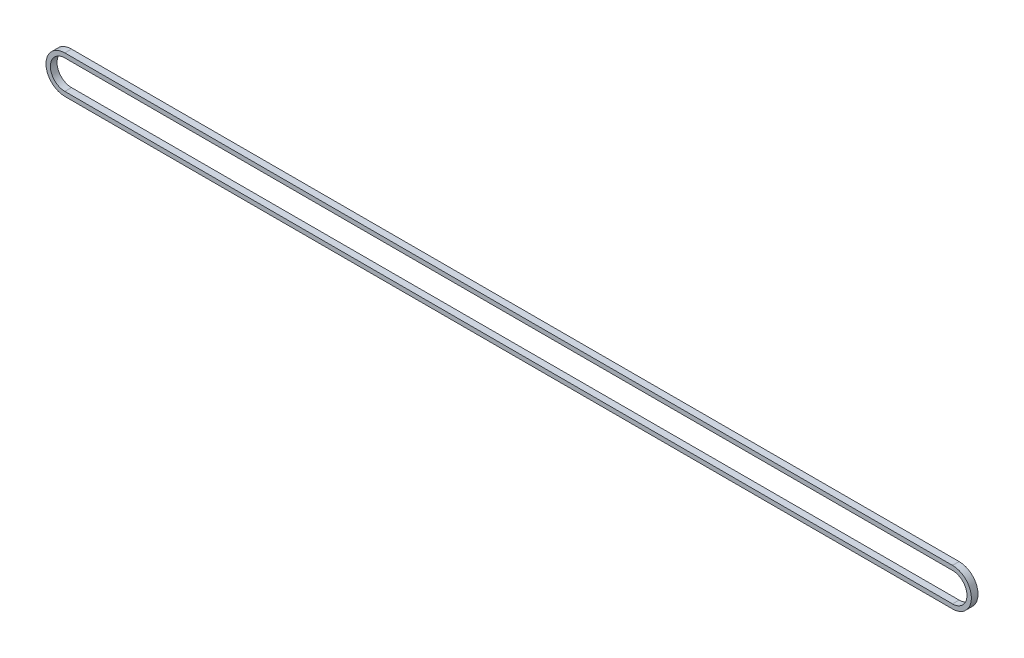
ISO-10303-21;
HEADER;
FILE_DESCRIPTION(('STEP AP214'),'2;1');
FILE_NAME('part.step','',(''),(''),'','','');
FILE_SCHEMA(('AUTOMOTIVE_DESIGN { 1 0 10303 214 1 1 1 1 }'));
ENDSEC;
DATA;
#1=APPLICATION_CONTEXT('core data for automotive mechanical design processes');
#2=APPLICATION_PROTOCOL_DEFINITION('international standard','automotive_design',2000,#1);
#3=PRODUCT_CONTEXT('',#1,'mechanical');
#4=PRODUCT('Part','Part','',(#3));
#5=PRODUCT_RELATED_PRODUCT_CATEGORY('part','',(#4));
#6=PRODUCT_DEFINITION_FORMATION('','',#4);
#7=PRODUCT_DEFINITION_CONTEXT('part definition',#1,'design');
#8=PRODUCT_DEFINITION('design','',#6,#7);
#9=PRODUCT_DEFINITION_SHAPE('','',#8);
#10=(LENGTH_UNIT() NAMED_UNIT(*) SI_UNIT(.MILLI.,.METRE.));
#11=(NAMED_UNIT(*) PLANE_ANGLE_UNIT() SI_UNIT($,.RADIAN.));
#12=(NAMED_UNIT(*) SI_UNIT($,.STERADIAN.) SOLID_ANGLE_UNIT());
#13=UNCERTAINTY_MEASURE_WITH_UNIT(LENGTH_MEASURE(1.E-05),#10,'distance_accuracy_value','');
#14=(GEOMETRIC_REPRESENTATION_CONTEXT(3) GLOBAL_UNCERTAINTY_ASSIGNED_CONTEXT((#13)) GLOBAL_UNIT_ASSIGNED_CONTEXT((#10,
#11,#12)) REPRESENTATION_CONTEXT('',''));
#15=CARTESIAN_POINT('',(0.,0.,0.));
#16=DIRECTION('',(0.,0.,1.));
#17=DIRECTION('',(1.,0.,0.));
#18=AXIS2_PLACEMENT_3D('',#15,#16,#17);
#19=CARTESIAN_POINT('',(0.,0.,4.445));
#20=DIRECTION('',(0.,0.,1.));
#21=DIRECTION('',(1.,0.,0.));
#22=AXIS2_PLACEMENT_3D('',#19,#20,#21);
#23=PLANE('',#22);
#24=CARTESIAN_POINT('',(0.,0.,4.445));
#25=DIRECTION('',(0.,0.,1.));
#26=DIRECTION('',(1.,0.,0.));
#27=AXIS2_PLACEMENT_3D('',#24,#25,#26);
#28=CIRCLE('',#27,25.23069053208);
#29=CARTESIAN_POINT('',(0.,25.23069053208,4.445));
#30=VERTEX_POINT('',#29);
#31=CARTESIAN_POINT('',(0.,-25.23069053208,4.445));
#32=VERTEX_POINT('',#31);
#33=EDGE_CURVE('E157',#30,#32,#28,.T.);
#34=ORIENTED_EDGE('',*,*,#33,.T.);
#35=DIRECTION('',(1.,0.,0.));
#36=VECTOR('',#35,1.);
#37=CARTESIAN_POINT('',(0.,-25.23069053208,4.445));
#38=LINE('',#37,#36);
#39=CARTESIAN_POINT('',(1187.45,-25.23069053208,4.445));
#40=VERTEX_POINT('',#39);
#41=EDGE_CURVE('E160',#32,#40,#38,.T.);
#42=ORIENTED_EDGE('',*,*,#41,.T.);
#43=CARTESIAN_POINT('',(1187.45,0.,4.445));
#44=DIRECTION('',(0.,0.,1.));
#45=DIRECTION('',(1.,0.,0.));
#46=AXIS2_PLACEMENT_3D('',#43,#44,#45);
#47=CIRCLE('',#46,25.23069053208);
#48=CARTESIAN_POINT('',(1187.45,25.23069053208,4.445));
#49=VERTEX_POINT('',#48);
#50=EDGE_CURVE('E163',#40,#49,#47,.T.);
#51=ORIENTED_EDGE('',*,*,#50,.T.);
#52=DIRECTION('',(-1.,0.,0.));
#53=VECTOR('',#52,1.);
#54=CARTESIAN_POINT('',(0.,25.23069053208,4.445));
#55=LINE('',#54,#53);
#56=EDGE_CURVE('E165',#49,#30,#55,.T.);
#57=ORIENTED_EDGE('',*,*,#56,.T.);
#58=EDGE_LOOP('',(#34,#42,#51,#57));
#59=FACE_BOUND('',#58,.T.);
#60=DIRECTION('',(1.,0.,0.));
#61=VECTOR('',#60,1.);
#62=CARTESIAN_POINT('',(0.,-19.38869053208,4.445));
#63=LINE('',#62,#61);
#64=CARTESIAN_POINT('',(0.,-19.38869053208,4.445));
#65=VERTEX_POINT('',#64);
#66=CARTESIAN_POINT('',(1187.45,-19.38869053208,4.445));
#67=VERTEX_POINT('',#66);
#68=EDGE_CURVE('E129',#65,#67,#63,.T.);
#69=ORIENTED_EDGE('',*,*,#68,.F.);
#70=CARTESIAN_POINT('',(0.,0.,4.445));
#71=DIRECTION('',(0.,0.,1.));
#72=DIRECTION('',(1.,0.,0.));
#73=AXIS2_PLACEMENT_3D('',#70,#71,#72);
#74=CIRCLE('',#73,19.38869053208);
#75=CARTESIAN_POINT('',(0.,19.38869053208,4.445));
#76=VERTEX_POINT('',#75);
#77=EDGE_CURVE('E121',#76,#65,#74,.T.);
#78=ORIENTED_EDGE('',*,*,#77,.F.);
#79=DIRECTION('',(-1.,0.,0.));
#80=VECTOR('',#79,1.);
#81=CARTESIAN_POINT('',(0.,19.38869053208,4.445));
#82=LINE('',#81,#80);
#83=CARTESIAN_POINT('',(1187.45,19.38869053208,4.445));
#84=VERTEX_POINT('',#83);
#85=EDGE_CURVE('E143',#84,#76,#82,.T.);
#86=ORIENTED_EDGE('',*,*,#85,.F.);
#87=CARTESIAN_POINT('',(1187.45,0.,4.445));
#88=DIRECTION('',(0.,0.,1.));
#89=DIRECTION('',(1.,0.,0.));
#90=AXIS2_PLACEMENT_3D('',#87,#88,#89);
#91=CIRCLE('',#90,19.38869053208);
#92=EDGE_CURVE('E141',#67,#84,#91,.T.);
#93=ORIENTED_EDGE('',*,*,#92,.F.);
#94=EDGE_LOOP('',(#69,#78,#86,#93));
#95=FACE_BOUND('',#94,.T.);
#96=ADVANCED_FACE('F56',(#59,#95),#23,.T.);
#97=CARTESIAN_POINT('',(0.,0.,-4.445));
#98=DIRECTION('',(0.,0.,1.));
#99=DIRECTION('',(1.,0.,0.));
#100=AXIS2_PLACEMENT_3D('',#97,#98,#99);
#101=PLANE('',#100);
#102=CARTESIAN_POINT('',(0.,0.,-4.445));
#103=DIRECTION('',(0.,0.,1.));
#104=DIRECTION('',(1.,0.,0.));
#105=AXIS2_PLACEMENT_3D('',#102,#103,#104);
#106=CIRCLE('',#105,25.23069053208);
#107=CARTESIAN_POINT('',(0.,25.23069053208,-4.445));
#108=VERTEX_POINT('',#107);
#109=CARTESIAN_POINT('',(0.,-25.23069053208,-4.445));
#110=VERTEX_POINT('',#109);
#111=EDGE_CURVE('E137',#108,#110,#106,.T.);
#112=ORIENTED_EDGE('',*,*,#111,.F.);
#113=DIRECTION('',(-1.,0.,0.));
#114=VECTOR('',#113,1.);
#115=CARTESIAN_POINT('',(0.,25.23069053208,-4.445));
#116=LINE('',#115,#114);
#117=CARTESIAN_POINT('',(1187.45,25.23069053208,-4.445));
#118=VERTEX_POINT('',#117);
#119=EDGE_CURVE('E161',#118,#108,#116,.T.);
#120=ORIENTED_EDGE('',*,*,#119,.F.);
#121=CARTESIAN_POINT('',(1187.45,0.,-4.445));
#122=DIRECTION('',(0.,0.,1.));
#123=DIRECTION('',(1.,0.,0.));
#124=AXIS2_PLACEMENT_3D('',#121,#122,#123);
#125=CIRCLE('',#124,25.23069053208);
#126=CARTESIAN_POINT('',(1187.45,-25.23069053208,-4.445));
#127=VERTEX_POINT('',#126);
#128=EDGE_CURVE('E172',#127,#118,#125,.T.);
#129=ORIENTED_EDGE('',*,*,#128,.F.);
#130=DIRECTION('',(1.,0.,0.));
#131=VECTOR('',#130,1.);
#132=CARTESIAN_POINT('',(0.,-25.23069053208,-4.445));
#133=LINE('',#132,#131);
#134=EDGE_CURVE('E170',#110,#127,#133,.T.);
#135=ORIENTED_EDGE('',*,*,#134,.F.);
#136=EDGE_LOOP('',(#112,#120,#129,#135));
#137=FACE_BOUND('',#136,.T.);
#138=CARTESIAN_POINT('',(0.,0.,-4.445));
#139=DIRECTION('',(0.,0.,1.));
#140=DIRECTION('',(1.,0.,0.));
#141=AXIS2_PLACEMENT_3D('',#138,#139,#140);
#142=CIRCLE('',#141,19.38869053208);
#143=CARTESIAN_POINT('',(0.,19.38869053208,-4.445));
#144=VERTEX_POINT('',#143);
#145=CARTESIAN_POINT('',(0.,-19.38869053208,-4.445));
#146=VERTEX_POINT('',#145);
#147=EDGE_CURVE('E79',#144,#146,#142,.T.);
#148=ORIENTED_EDGE('',*,*,#147,.T.);
#149=DIRECTION('',(1.,0.,0.));
#150=VECTOR('',#149,1.);
#151=CARTESIAN_POINT('',(0.,-19.38869053208,-4.445));
#152=LINE('',#151,#150);
#153=CARTESIAN_POINT('',(1187.45,-19.38869053208,-4.445));
#154=VERTEX_POINT('',#153);
#155=EDGE_CURVE('E136',#146,#154,#152,.T.);
#156=ORIENTED_EDGE('',*,*,#155,.T.);
#157=CARTESIAN_POINT('',(1187.45,0.,-4.445));
#158=DIRECTION('',(0.,0.,1.));
#159=DIRECTION('',(1.,0.,0.));
#160=AXIS2_PLACEMENT_3D('',#157,#158,#159);
#161=CIRCLE('',#160,19.38869053208);
#162=CARTESIAN_POINT('',(1187.45,19.38869053208,-4.445));
#163=VERTEX_POINT('',#162);
#164=EDGE_CURVE('E149',#154,#163,#161,.T.);
#165=ORIENTED_EDGE('',*,*,#164,.T.);
#166=DIRECTION('',(-1.,0.,0.));
#167=VECTOR('',#166,1.);
#168=CARTESIAN_POINT('',(0.,19.38869053208,-4.445));
#169=LINE('',#168,#167);
#170=EDGE_CURVE('E130',#163,#144,#169,.T.);
#171=ORIENTED_EDGE('',*,*,#170,.T.);
#172=EDGE_LOOP('',(#148,#156,#165,#171));
#173=FACE_BOUND('',#172,.T.);
#174=ADVANCED_FACE('F190',(#137,#173),#101,.F.);
#175=CARTESIAN_POINT('',(0.,0.,4.445));
#176=DIRECTION('',(0.,0.,-1.));
#177=DIRECTION('',(-1.,0.,0.));
#178=AXIS2_PLACEMENT_3D('',#175,#176,#177);
#179=CYLINDRICAL_SURFACE('',#178,25.23069053208);
#180=ORIENTED_EDGE('',*,*,#111,.T.);
#181=DIRECTION('',(0.,0.,-1.));
#182=VECTOR('',#181,1.);
#183=CARTESIAN_POINT('',(0.,-25.23069053208,4.445));
#184=LINE('',#183,#182);
#185=EDGE_CURVE('E12',#32,#110,#184,.T.);
#186=ORIENTED_EDGE('',*,*,#185,.F.);
#187=ORIENTED_EDGE('',*,*,#33,.F.);
#188=DIRECTION('',(0.,0.,-1.));
#189=VECTOR('',#188,1.);
#190=CARTESIAN_POINT('',(0.,25.23069053208,4.445));
#191=LINE('',#190,#189);
#192=EDGE_CURVE('E167',#30,#108,#191,.T.);
#193=ORIENTED_EDGE('',*,*,#192,.T.);
#194=EDGE_LOOP('',(#180,#186,#187,#193));
#195=FACE_BOUND('',#194,.T.);
#196=ADVANCED_FACE('F58',(#195),#179,.T.);
#197=CARTESIAN_POINT('',(0.,-25.23069053208,4.445));
#198=DIRECTION('',(0.,1.,0.));
#199=DIRECTION('',(0.,0.,1.));
#200=AXIS2_PLACEMENT_3D('',#197,#198,#199);
#201=PLANE('',#200);
#202=ORIENTED_EDGE('',*,*,#134,.T.);
#203=DIRECTION('',(0.,0.,-1.));
#204=VECTOR('',#203,1.);
#205=CARTESIAN_POINT('',(1187.45,-25.23069053208,4.445));
#206=LINE('',#205,#204);
#207=EDGE_CURVE('E64',#40,#127,#206,.T.);
#208=ORIENTED_EDGE('',*,*,#207,.F.);
#209=ORIENTED_EDGE('',*,*,#41,.F.);
#210=ORIENTED_EDGE('',*,*,#185,.T.);
#211=EDGE_LOOP('',(#202,#208,#209,#210));
#212=FACE_BOUND('',#211,.T.);
#213=ADVANCED_FACE('F200',(#212),#201,.F.);
#214=CARTESIAN_POINT('',(1187.45,0.,4.445));
#215=DIRECTION('',(0.,0.,-1.));
#216=DIRECTION('',(-1.,0.,0.));
#217=AXIS2_PLACEMENT_3D('',#214,#215,#216);
#218=CYLINDRICAL_SURFACE('',#217,25.23069053208);
#219=ORIENTED_EDGE('',*,*,#128,.T.);
#220=DIRECTION('',(0.,0.,-1.));
#221=VECTOR('',#220,1.);
#222=CARTESIAN_POINT('',(1187.45,25.23069053208,4.445));
#223=LINE('',#222,#221);
#224=EDGE_CURVE('E177',#49,#118,#223,.T.);
#225=ORIENTED_EDGE('',*,*,#224,.F.);
#226=ORIENTED_EDGE('',*,*,#50,.F.);
#227=ORIENTED_EDGE('',*,*,#207,.T.);
#228=EDGE_LOOP('',(#219,#225,#226,#227));
#229=FACE_BOUND('',#228,.T.);
#230=ADVANCED_FACE('F184',(#229),#218,.T.);
#231=CARTESIAN_POINT('',(0.,25.23069053208,4.445));
#232=DIRECTION('',(0.,-1.,0.));
#233=DIRECTION('',(0.,0.,-1.));
#234=AXIS2_PLACEMENT_3D('',#231,#232,#233);
#235=PLANE('',#234);
#236=ORIENTED_EDGE('',*,*,#119,.T.);
#237=ORIENTED_EDGE('',*,*,#192,.F.);
#238=ORIENTED_EDGE('',*,*,#56,.F.);
#239=ORIENTED_EDGE('',*,*,#224,.T.);
#240=EDGE_LOOP('',(#236,#237,#238,#239));
#241=FACE_BOUND('',#240,.T.);
#242=ADVANCED_FACE('F194',(#241),#235,.F.);
#243=CARTESIAN_POINT('',(0.,0.,4.445));
#244=DIRECTION('',(0.,0.,-1.));
#245=DIRECTION('',(-1.,0.,0.));
#246=AXIS2_PLACEMENT_3D('',#243,#244,#245);
#247=CYLINDRICAL_SURFACE('',#246,19.38869053208);
#248=ORIENTED_EDGE('',*,*,#147,.F.);
#249=DIRECTION('',(0.,0.,-1.));
#250=VECTOR('',#249,1.);
#251=CARTESIAN_POINT('',(0.,19.38869053208,4.445));
#252=LINE('',#251,#250);
#253=EDGE_CURVE('E125',#76,#144,#252,.T.);
#254=ORIENTED_EDGE('',*,*,#253,.F.);
#255=ORIENTED_EDGE('',*,*,#77,.T.);
#256=DIRECTION('',(0.,0.,-1.));
#257=VECTOR('',#256,1.);
#258=CARTESIAN_POINT('',(0.,-19.38869053208,4.445));
#259=LINE('',#258,#257);
#260=EDGE_CURVE('E124',#65,#146,#259,.T.);
#261=ORIENTED_EDGE('',*,*,#260,.T.);
#262=EDGE_LOOP('',(#248,#254,#255,#261));
#263=FACE_BOUND('',#262,.T.);
#264=ADVANCED_FACE('F123',(#263),#247,.F.);
#265=CARTESIAN_POINT('',(0.,-19.38869053208,4.445));
#266=DIRECTION('',(0.,1.,0.));
#267=DIRECTION('',(0.,0.,1.));
#268=AXIS2_PLACEMENT_3D('',#265,#266,#267);
#269=PLANE('',#268);
#270=ORIENTED_EDGE('',*,*,#155,.F.);
#271=ORIENTED_EDGE('',*,*,#260,.F.);
#272=ORIENTED_EDGE('',*,*,#68,.T.);
#273=DIRECTION('',(0.,0.,-1.));
#274=VECTOR('',#273,1.);
#275=CARTESIAN_POINT('',(1187.45,-19.38869053208,4.445));
#276=LINE('',#275,#274);
#277=EDGE_CURVE('E138',#67,#154,#276,.T.);
#278=ORIENTED_EDGE('',*,*,#277,.T.);
#279=EDGE_LOOP('',(#270,#271,#272,#278));
#280=FACE_BOUND('',#279,.T.);
#281=ADVANCED_FACE('F133',(#280),#269,.T.);
#282=CARTESIAN_POINT('',(1187.45,0.,4.445));
#283=DIRECTION('',(0.,0.,-1.));
#284=DIRECTION('',(-1.,0.,0.));
#285=AXIS2_PLACEMENT_3D('',#282,#283,#284);
#286=CYLINDRICAL_SURFACE('',#285,19.38869053208);
#287=ORIENTED_EDGE('',*,*,#164,.F.);
#288=ORIENTED_EDGE('',*,*,#277,.F.);
#289=ORIENTED_EDGE('',*,*,#92,.T.);
#290=DIRECTION('',(0.,0.,-1.));
#291=VECTOR('',#290,1.);
#292=CARTESIAN_POINT('',(1187.45,19.38869053208,4.445));
#293=LINE('',#292,#291);
#294=EDGE_CURVE('E71',#84,#163,#293,.T.);
#295=ORIENTED_EDGE('',*,*,#294,.T.);
#296=EDGE_LOOP('',(#287,#288,#289,#295));
#297=FACE_BOUND('',#296,.T.);
#298=ADVANCED_FACE('F223',(#297),#286,.F.);
#299=CARTESIAN_POINT('',(0.,19.38869053208,4.445));
#300=DIRECTION('',(0.,-1.,0.));
#301=DIRECTION('',(0.,0.,-1.));
#302=AXIS2_PLACEMENT_3D('',#299,#300,#301);
#303=PLANE('',#302);
#304=ORIENTED_EDGE('',*,*,#170,.F.);
#305=ORIENTED_EDGE('',*,*,#294,.F.);
#306=ORIENTED_EDGE('',*,*,#85,.T.);
#307=ORIENTED_EDGE('',*,*,#253,.T.);
#308=EDGE_LOOP('',(#304,#305,#306,#307));
#309=FACE_BOUND('',#308,.T.);
#310=ADVANCED_FACE('F227',(#309),#303,.T.);
#311=CLOSED_SHELL('',(#96,#174,#196,#213,#230,#242,#264,#281,#298,#310));
#312=MANIFOLD_SOLID_BREP('B2',#311);
#313=ADVANCED_BREP_SHAPE_REPRESENTATION('',(#18,#312),#14);
#314=SHAPE_DEFINITION_REPRESENTATION(#9,#313);
ENDSEC;
END-ISO-10303-21;
